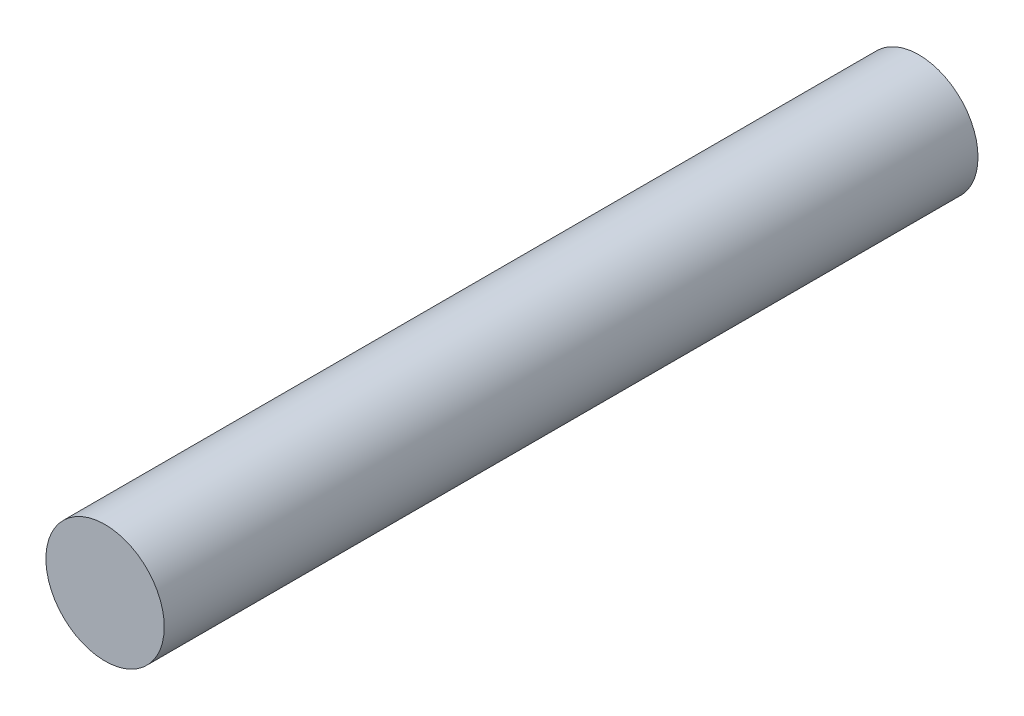
ISO-10303-21;
HEADER;
FILE_DESCRIPTION(('STEP AP214'),'2;1');
FILE_NAME('part.step','',(''),(''),'','','');
FILE_SCHEMA(('AUTOMOTIVE_DESIGN { 1 0 10303 214 1 1 1 1 }'));
ENDSEC;
DATA;
#1=APPLICATION_CONTEXT('core data for automotive mechanical design processes');
#2=APPLICATION_PROTOCOL_DEFINITION('international standard','automotive_design',2000,#1);
#3=PRODUCT_CONTEXT('',#1,'mechanical');
#4=PRODUCT('Part','Part','',(#3));
#5=PRODUCT_RELATED_PRODUCT_CATEGORY('part','',(#4));
#6=PRODUCT_DEFINITION_FORMATION('','',#4);
#7=PRODUCT_DEFINITION_CONTEXT('part definition',#1,'design');
#8=PRODUCT_DEFINITION('design','',#6,#7);
#9=PRODUCT_DEFINITION_SHAPE('','',#8);
#10=(LENGTH_UNIT() NAMED_UNIT(*) SI_UNIT(.MILLI.,.METRE.));
#11=(NAMED_UNIT(*) PLANE_ANGLE_UNIT() SI_UNIT($,.RADIAN.));
#12=(NAMED_UNIT(*) SI_UNIT($,.STERADIAN.) SOLID_ANGLE_UNIT());
#13=UNCERTAINTY_MEASURE_WITH_UNIT(LENGTH_MEASURE(1.E-05),#10,'distance_accuracy_value','');
#14=(GEOMETRIC_REPRESENTATION_CONTEXT(3) GLOBAL_UNCERTAINTY_ASSIGNED_CONTEXT((#13)) GLOBAL_UNIT_ASSIGNED_CONTEXT((#10,
#11,#12)) REPRESENTATION_CONTEXT('',''));
#15=CARTESIAN_POINT('',(0.,0.,0.));
#16=DIRECTION('',(0.,0.,1.));
#17=DIRECTION('',(1.,0.,0.));
#18=AXIS2_PLACEMENT_3D('',#15,#16,#17);
#19=CARTESIAN_POINT('',(0.,0.,27.5));
#20=DIRECTION('',(0.,0.,-1.));
#21=DIRECTION('',(-1.,0.,0.));
#22=AXIS2_PLACEMENT_3D('',#19,#20,#21);
#23=CYLINDRICAL_SURFACE('',#22,2.);
#24=CARTESIAN_POINT('',(0.,0.,27.5));
#25=DIRECTION('',(0.,0.,1.));
#26=DIRECTION('',(1.,0.,0.));
#27=AXIS2_PLACEMENT_3D('',#24,#25,#26);
#28=CIRCLE('',#27,2.);
#29=CARTESIAN_POINT('',(2.,0.,27.5));
#30=VERTEX_POINT('',#29);
#31=EDGE_CURVE('E10',#30,#30,#28,.T.);
#32=ORIENTED_EDGE('',*,*,#31,.F.);
#33=EDGE_LOOP('',(#32));
#34=FACE_BOUND('',#33,.T.);
#35=CARTESIAN_POINT('',(0.,0.,0.));
#36=DIRECTION('',(0.,0.,1.));
#37=DIRECTION('',(1.,0.,0.));
#38=AXIS2_PLACEMENT_3D('',#35,#36,#37);
#39=CIRCLE('',#38,2.);
#40=CARTESIAN_POINT('',(2.,0.,0.));
#41=VERTEX_POINT('',#40);
#42=EDGE_CURVE('E35',#41,#41,#39,.T.);
#43=ORIENTED_EDGE('',*,*,#42,.T.);
#44=EDGE_LOOP('',(#43));
#45=FACE_BOUND('',#44,.T.);
#46=ADVANCED_FACE('F32',(#34,#45),#23,.T.);
#47=CARTESIAN_POINT('',(0.,0.,27.5));
#48=DIRECTION('',(0.,0.,1.));
#49=DIRECTION('',(1.,0.,0.));
#50=AXIS2_PLACEMENT_3D('',#47,#48,#49);
#51=PLANE('',#50);
#52=ORIENTED_EDGE('',*,*,#31,.T.);
#53=EDGE_LOOP('',(#52));
#54=FACE_BOUND('',#53,.T.);
#55=ADVANCED_FACE('F47',(#54),#51,.T.);
#56=CARTESIAN_POINT('',(0.,0.,0.));
#57=DIRECTION('',(0.,0.,1.));
#58=DIRECTION('',(1.,0.,0.));
#59=AXIS2_PLACEMENT_3D('',#56,#57,#58);
#60=PLANE('',#59);
#61=ORIENTED_EDGE('',*,*,#42,.F.);
#62=EDGE_LOOP('',(#61));
#63=FACE_BOUND('',#62,.T.);
#64=ADVANCED_FACE('F45',(#63),#60,.F.);
#65=CLOSED_SHELL('',(#46,#55,#64));
#66=MANIFOLD_SOLID_BREP('B2',#65);
#67=ADVANCED_BREP_SHAPE_REPRESENTATION('',(#18,#66),#14);
#68=SHAPE_DEFINITION_REPRESENTATION(#9,#67);
ENDSEC;
END-ISO-10303-21;
